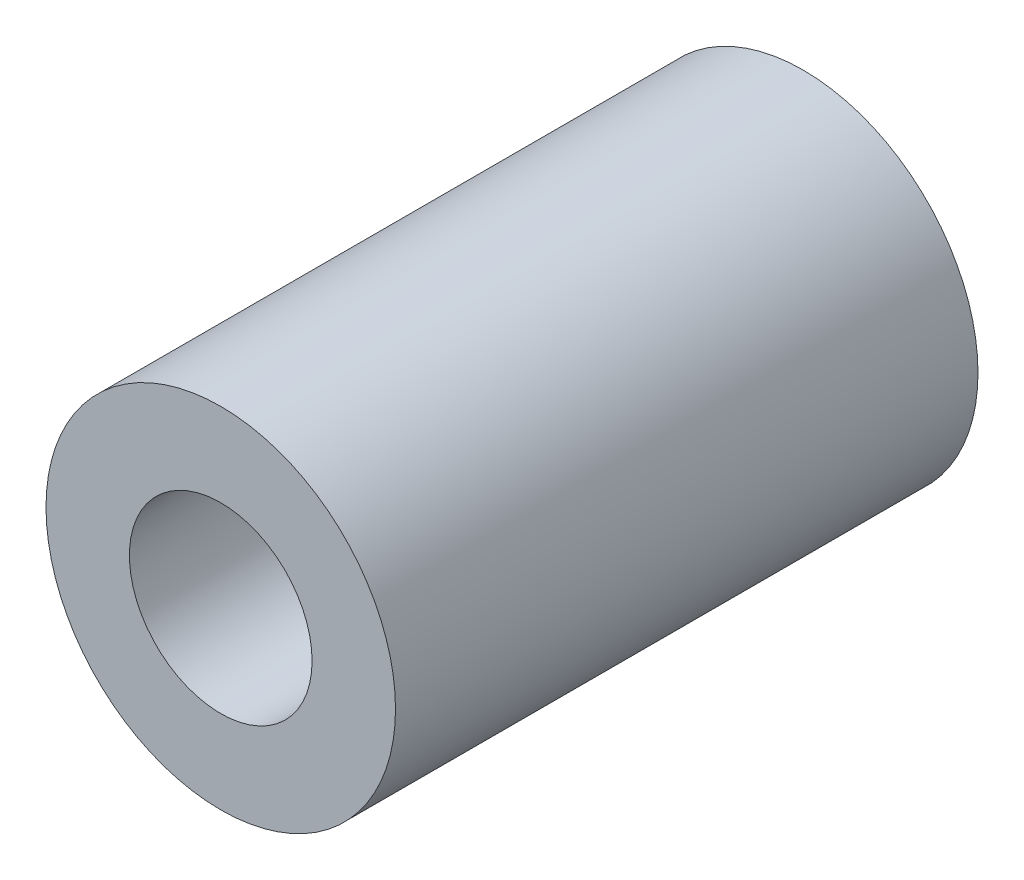
ISO-10303-21;
HEADER;
FILE_DESCRIPTION(('STEP AP214'),'2;1');
FILE_NAME('part.step','',(''),(''),'','','');
FILE_SCHEMA(('AUTOMOTIVE_DESIGN { 1 0 10303 214 1 1 1 1 }'));
ENDSEC;
DATA;
#1=APPLICATION_CONTEXT('core data for automotive mechanical design processes');
#2=APPLICATION_PROTOCOL_DEFINITION('international standard','automotive_design',2000,#1);
#3=PRODUCT_CONTEXT('',#1,'mechanical');
#4=PRODUCT('Part','Part','',(#3));
#5=PRODUCT_RELATED_PRODUCT_CATEGORY('part','',(#4));
#6=PRODUCT_DEFINITION_FORMATION('','',#4);
#7=PRODUCT_DEFINITION_CONTEXT('part definition',#1,'design');
#8=PRODUCT_DEFINITION('design','',#6,#7);
#9=PRODUCT_DEFINITION_SHAPE('','',#8);
#10=(LENGTH_UNIT() NAMED_UNIT(*) SI_UNIT(.MILLI.,.METRE.));
#11=(NAMED_UNIT(*) PLANE_ANGLE_UNIT() SI_UNIT($,.RADIAN.));
#12=(NAMED_UNIT(*) SI_UNIT($,.STERADIAN.) SOLID_ANGLE_UNIT());
#13=UNCERTAINTY_MEASURE_WITH_UNIT(LENGTH_MEASURE(1.E-05),#10,'distance_accuracy_value','');
#14=(GEOMETRIC_REPRESENTATION_CONTEXT(3) GLOBAL_UNCERTAINTY_ASSIGNED_CONTEXT((#13)) GLOBAL_UNIT_ASSIGNED_CONTEXT((#10,
#11,#12)) REPRESENTATION_CONTEXT('',''));
#15=CARTESIAN_POINT('',(0.,0.,0.));
#16=DIRECTION('',(0.,0.,1.));
#17=DIRECTION('',(1.,0.,0.));
#18=AXIS2_PLACEMENT_3D('',#15,#16,#17);
#19=CARTESIAN_POINT('',(0.,0.,15.875));
#20=DIRECTION('',(0.,0.,-1.));
#21=DIRECTION('',(-1.,0.,0.));
#22=AXIS2_PLACEMENT_3D('',#19,#20,#21);
#23=CYLINDRICAL_SURFACE('',#22,2.4892);
#24=CARTESIAN_POINT('',(0.,0.,15.875));
#25=DIRECTION('',(0.,0.,1.));
#26=DIRECTION('',(1.,0.,0.));
#27=AXIS2_PLACEMENT_3D('',#24,#25,#26);
#28=CIRCLE('',#27,2.4892);
#29=CARTESIAN_POINT('',(2.4892,0.,15.875));
#30=VERTEX_POINT('',#29);
#31=EDGE_CURVE('E45',#30,#30,#28,.T.);
#32=ORIENTED_EDGE('',*,*,#31,.T.);
#33=EDGE_LOOP('',(#32));
#34=FACE_BOUND('',#33,.T.);
#35=CARTESIAN_POINT('',(0.,0.,0.));
#36=DIRECTION('',(0.,0.,1.));
#37=DIRECTION('',(1.,0.,0.));
#38=AXIS2_PLACEMENT_3D('',#35,#36,#37);
#39=CIRCLE('',#38,2.4892);
#40=CARTESIAN_POINT('',(2.4892,0.,0.));
#41=VERTEX_POINT('',#40);
#42=EDGE_CURVE('E52',#41,#41,#39,.T.);
#43=ORIENTED_EDGE('',*,*,#42,.F.);
#44=EDGE_LOOP('',(#43));
#45=FACE_BOUND('',#44,.T.);
#46=ADVANCED_FACE('F37',(#34,#45),#23,.F.);
#47=CARTESIAN_POINT('',(0.,0.,15.875));
#48=DIRECTION('',(0.,0.,-1.));
#49=DIRECTION('',(-1.,0.,0.));
#50=AXIS2_PLACEMENT_3D('',#47,#48,#49);
#51=CYLINDRICAL_SURFACE('',#50,4.7625);
#52=CARTESIAN_POINT('',(0.,0.,15.875));
#53=DIRECTION('',(0.,0.,1.));
#54=DIRECTION('',(1.,0.,0.));
#55=AXIS2_PLACEMENT_3D('',#52,#53,#54);
#56=CIRCLE('',#55,4.7625);
#57=CARTESIAN_POINT('',(4.7625,0.,15.875));
#58=VERTEX_POINT('',#57);
#59=EDGE_CURVE('E10',#58,#58,#56,.T.);
#60=ORIENTED_EDGE('',*,*,#59,.F.);
#61=EDGE_LOOP('',(#60));
#62=FACE_BOUND('',#61,.T.);
#63=CARTESIAN_POINT('',(0.,0.,0.));
#64=DIRECTION('',(0.,0.,1.));
#65=DIRECTION('',(1.,0.,0.));
#66=AXIS2_PLACEMENT_3D('',#63,#64,#65);
#67=CIRCLE('',#66,4.7625);
#68=CARTESIAN_POINT('',(4.7625,0.,0.));
#69=VERTEX_POINT('',#68);
#70=EDGE_CURVE('E40',#69,#69,#67,.T.);
#71=ORIENTED_EDGE('',*,*,#70,.T.);
#72=EDGE_LOOP('',(#71));
#73=FACE_BOUND('',#72,.T.);
#74=ADVANCED_FACE('F61',(#62,#73),#51,.T.);
#75=CARTESIAN_POINT('',(0.,0.,15.875));
#76=DIRECTION('',(0.,0.,1.));
#77=DIRECTION('',(1.,0.,0.));
#78=AXIS2_PLACEMENT_3D('',#75,#76,#77);
#79=PLANE('',#78);
#80=ORIENTED_EDGE('',*,*,#31,.F.);
#81=EDGE_LOOP('',(#80));
#82=FACE_BOUND('',#81,.T.);
#83=ORIENTED_EDGE('',*,*,#59,.T.);
#84=EDGE_LOOP('',(#83));
#85=FACE_BOUND('',#84,.T.);
#86=ADVANCED_FACE('F65',(#82,#85),#79,.T.);
#87=CARTESIAN_POINT('',(0.,0.,0.));
#88=DIRECTION('',(0.,0.,1.));
#89=DIRECTION('',(1.,0.,0.));
#90=AXIS2_PLACEMENT_3D('',#87,#88,#89);
#91=PLANE('',#90);
#92=ORIENTED_EDGE('',*,*,#42,.T.);
#93=EDGE_LOOP('',(#92));
#94=FACE_BOUND('',#93,.T.);
#95=ORIENTED_EDGE('',*,*,#70,.F.);
#96=EDGE_LOOP('',(#95));
#97=FACE_BOUND('',#96,.T.);
#98=ADVANCED_FACE('F63',(#94,#97),#91,.F.);
#99=CLOSED_SHELL('',(#46,#74,#86,#98));
#100=MANIFOLD_SOLID_BREP('B2',#99);
#101=ADVANCED_BREP_SHAPE_REPRESENTATION('',(#18,#100),#14);
#102=SHAPE_DEFINITION_REPRESENTATION(#9,#101);
ENDSEC;
END-ISO-10303-21;
